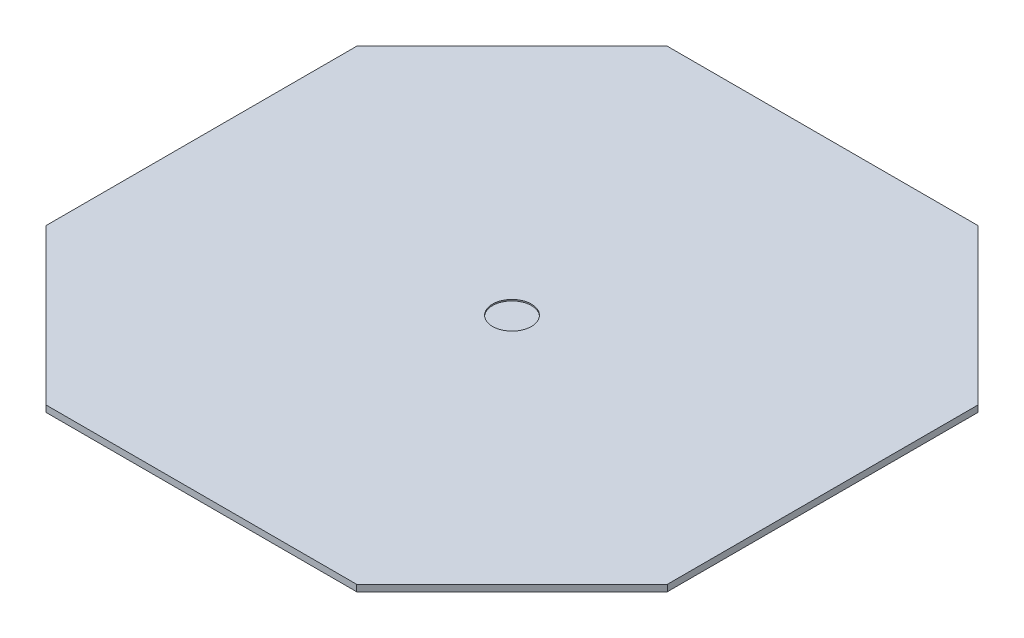
ISO-10303-21;
HEADER;
FILE_DESCRIPTION(('STEP AP214'),'2;1');
FILE_NAME('part.step','',(''),(''),'','','');
FILE_SCHEMA(('AUTOMOTIVE_DESIGN { 1 0 10303 214 1 1 1 1 }'));
ENDSEC;
DATA;
#1=APPLICATION_CONTEXT('core data for automotive mechanical design processes');
#2=APPLICATION_PROTOCOL_DEFINITION('international standard','automotive_design',2000,#1);
#3=PRODUCT_CONTEXT('',#1,'mechanical');
#4=PRODUCT('Part','Part','',(#3));
#5=PRODUCT_RELATED_PRODUCT_CATEGORY('part','',(#4));
#6=PRODUCT_DEFINITION_FORMATION('','',#4);
#7=PRODUCT_DEFINITION_CONTEXT('part definition',#1,'design');
#8=PRODUCT_DEFINITION('design','',#6,#7);
#9=PRODUCT_DEFINITION_SHAPE('','',#8);
#10=(LENGTH_UNIT() NAMED_UNIT(*) SI_UNIT(.MILLI.,.METRE.));
#11=(NAMED_UNIT(*) PLANE_ANGLE_UNIT() SI_UNIT($,.RADIAN.));
#12=(NAMED_UNIT(*) SI_UNIT($,.STERADIAN.) SOLID_ANGLE_UNIT());
#13=UNCERTAINTY_MEASURE_WITH_UNIT(LENGTH_MEASURE(1.E-05),#10,'distance_accuracy_value','');
#14=(GEOMETRIC_REPRESENTATION_CONTEXT(3) GLOBAL_UNCERTAINTY_ASSIGNED_CONTEXT((#13)) GLOBAL_UNIT_ASSIGNED_CONTEXT((#10,
#11,#12)) REPRESENTATION_CONTEXT('',''));
#15=CARTESIAN_POINT('',(0.,0.,0.));
#16=DIRECTION('',(0.,0.,1.));
#17=DIRECTION('',(1.,0.,0.));
#18=AXIS2_PLACEMENT_3D('',#15,#16,#17);
#19=CARTESIAN_POINT('',(-457.2,12.7,-457.2));
#20=DIRECTION('',(-0.707106781186547,0.,-0.707106781186548));
#21=DIRECTION('',(-0.707106781186548,0.,0.707106781186547));
#22=AXIS2_PLACEMENT_3D('',#19,#20,#21);
#23=PLANE('',#22);
#24=DIRECTION('',(0.707106781186548,0.,-0.707106781186547));
#25=VECTOR('',#24,1.);
#26=CARTESIAN_POINT('',(-457.2,0.,-457.2));
#27=LINE('',#26,#25);
#28=CARTESIAN_POINT('',(-609.6,0.,-304.8));
#29=VERTEX_POINT('',#28);
#30=CARTESIAN_POINT('',(-304.8,0.,-609.6));
#31=VERTEX_POINT('',#30);
#32=EDGE_CURVE('E128',#29,#31,#27,.T.);
#33=ORIENTED_EDGE('',*,*,#32,.F.);
#34=DIRECTION('',(0.,-1.,0.));
#35=VECTOR('',#34,1.);
#36=CARTESIAN_POINT('',(-609.6,12.7,-304.8));
#37=LINE('',#36,#35);
#38=CARTESIAN_POINT('',(-609.6,12.7,-304.8));
#39=VERTEX_POINT('',#38);
#40=EDGE_CURVE('E11',#39,#29,#37,.T.);
#41=ORIENTED_EDGE('',*,*,#40,.F.);
#42=DIRECTION('',(0.707106781186548,0.,-0.707106781186547));
#43=VECTOR('',#42,1.);
#44=CARTESIAN_POINT('',(-457.2,12.7,-457.2));
#45=LINE('',#44,#43);
#46=CARTESIAN_POINT('',(-304.8,12.7,-609.6));
#47=VERTEX_POINT('',#46);
#48=EDGE_CURVE('E149',#39,#47,#45,.T.);
#49=ORIENTED_EDGE('',*,*,#48,.T.);
#50=DIRECTION('',(0.,-1.,0.));
#51=VECTOR('',#50,1.);
#52=CARTESIAN_POINT('',(-304.8,12.7,-609.6));
#53=LINE('',#52,#51);
#54=EDGE_CURVE('E51',#47,#31,#53,.T.);
#55=ORIENTED_EDGE('',*,*,#54,.T.);
#56=EDGE_LOOP('',(#33,#41,#49,#55));
#57=FACE_BOUND('',#56,.T.);
#58=ADVANCED_FACE('F35',(#57),#23,.T.);
#59=CARTESIAN_POINT('',(-609.6,12.7,1.11022302462516E-13));
#60=DIRECTION('',(-1.,0.,0.));
#61=DIRECTION('',(0.,0.,1.));
#62=AXIS2_PLACEMENT_3D('',#59,#60,#61);
#63=PLANE('',#62);
#64=DIRECTION('',(0.,0.,-1.));
#65=VECTOR('',#64,1.);
#66=CARTESIAN_POINT('',(-609.6,0.,1.11022302462516E-13));
#67=LINE('',#66,#65);
#68=CARTESIAN_POINT('',(-609.6,0.,304.8));
#69=VERTEX_POINT('',#68);
#70=EDGE_CURVE('E130',#69,#29,#67,.T.);
#71=ORIENTED_EDGE('',*,*,#70,.F.);
#72=DIRECTION('',(0.,-1.,0.));
#73=VECTOR('',#72,1.);
#74=CARTESIAN_POINT('',(-609.6,12.7,304.8));
#75=LINE('',#74,#73);
#76=CARTESIAN_POINT('',(-609.6,12.7,304.8));
#77=VERTEX_POINT('',#76);
#78=EDGE_CURVE('E43',#77,#69,#75,.T.);
#79=ORIENTED_EDGE('',*,*,#78,.F.);
#80=DIRECTION('',(0.,0.,-1.));
#81=VECTOR('',#80,1.);
#82=CARTESIAN_POINT('',(-609.6,12.7,1.11022302462516E-13));
#83=LINE('',#82,#81);
#84=EDGE_CURVE('E175',#77,#39,#83,.T.);
#85=ORIENTED_EDGE('',*,*,#84,.T.);
#86=ORIENTED_EDGE('',*,*,#40,.T.);
#87=EDGE_LOOP('',(#71,#79,#85,#86));
#88=FACE_BOUND('',#87,.T.);
#89=ADVANCED_FACE('F166',(#88),#63,.T.);
#90=CARTESIAN_POINT('',(-457.2,12.7,457.2));
#91=DIRECTION('',(-0.707106781186547,0.,0.707106781186548));
#92=DIRECTION('',(0.707106781186548,0.,0.707106781186547));
#93=AXIS2_PLACEMENT_3D('',#90,#91,#92);
#94=PLANE('',#93);
#95=DIRECTION('',(-0.707106781186548,0.,-0.707106781186547));
#96=VECTOR('',#95,1.);
#97=CARTESIAN_POINT('',(-457.2,0.,457.2));
#98=LINE('',#97,#96);
#99=CARTESIAN_POINT('',(-304.8,0.,609.6));
#100=VERTEX_POINT('',#99);
#101=EDGE_CURVE('E134',#100,#69,#98,.T.);
#102=ORIENTED_EDGE('',*,*,#101,.F.);
#103=DIRECTION('',(0.,-1.,0.));
#104=VECTOR('',#103,1.);
#105=CARTESIAN_POINT('',(-304.8,12.7,609.6));
#106=LINE('',#105,#104);
#107=CARTESIAN_POINT('',(-304.8,12.7,609.6));
#108=VERTEX_POINT('',#107);
#109=EDGE_CURVE('E155',#108,#100,#106,.T.);
#110=ORIENTED_EDGE('',*,*,#109,.F.);
#111=DIRECTION('',(-0.707106781186548,0.,-0.707106781186547));
#112=VECTOR('',#111,1.);
#113=CARTESIAN_POINT('',(-457.2,12.7,457.2));
#114=LINE('',#113,#112);
#115=EDGE_CURVE('E162',#108,#77,#114,.T.);
#116=ORIENTED_EDGE('',*,*,#115,.T.);
#117=ORIENTED_EDGE('',*,*,#78,.T.);
#118=EDGE_LOOP('',(#102,#110,#116,#117));
#119=FACE_BOUND('',#118,.T.);
#120=ADVANCED_FACE('F160',(#119),#94,.T.);
#121=CARTESIAN_POINT('',(1.11022302462516E-13,12.7,609.6));
#122=DIRECTION('',(0.,0.,1.));
#123=DIRECTION('',(1.,0.,0.));
#124=AXIS2_PLACEMENT_3D('',#121,#122,#123);
#125=PLANE('',#124);
#126=DIRECTION('',(-1.,0.,0.));
#127=VECTOR('',#126,1.);
#128=CARTESIAN_POINT('',(1.11022302462516E-13,0.,609.6));
#129=LINE('',#128,#127);
#130=CARTESIAN_POINT('',(304.8,0.,609.6));
#131=VERTEX_POINT('',#130);
#132=EDGE_CURVE('E137',#131,#100,#129,.T.);
#133=ORIENTED_EDGE('',*,*,#132,.F.);
#134=DIRECTION('',(0.,-1.,0.));
#135=VECTOR('',#134,1.);
#136=CARTESIAN_POINT('',(304.8,12.7,609.6));
#137=LINE('',#136,#135);
#138=CARTESIAN_POINT('',(304.8,12.7,609.6));
#139=VERTEX_POINT('',#138);
#140=EDGE_CURVE('E153',#139,#131,#137,.T.);
#141=ORIENTED_EDGE('',*,*,#140,.F.);
#142=DIRECTION('',(-1.,0.,0.));
#143=VECTOR('',#142,1.);
#144=CARTESIAN_POINT('',(1.11022302462516E-13,12.7,609.6));
#145=LINE('',#144,#143);
#146=EDGE_CURVE('E174',#139,#108,#145,.T.);
#147=ORIENTED_EDGE('',*,*,#146,.T.);
#148=ORIENTED_EDGE('',*,*,#109,.T.);
#149=EDGE_LOOP('',(#133,#141,#147,#148));
#150=FACE_BOUND('',#149,.T.);
#151=ADVANCED_FACE('F172',(#150),#125,.T.);
#152=CARTESIAN_POINT('',(457.2,12.7,457.2));
#153=DIRECTION('',(0.707106781186548,0.,0.707106781186548));
#154=DIRECTION('',(0.707106781186548,0.,-0.707106781186548));
#155=AXIS2_PLACEMENT_3D('',#152,#153,#154);
#156=PLANE('',#155);
#157=DIRECTION('',(-0.707106781186548,0.,0.707106781186548));
#158=VECTOR('',#157,1.);
#159=CARTESIAN_POINT('',(457.2,0.,457.2));
#160=LINE('',#159,#158);
#161=CARTESIAN_POINT('',(609.6,0.,304.8));
#162=VERTEX_POINT('',#161);
#163=EDGE_CURVE('E140',#162,#131,#160,.T.);
#164=ORIENTED_EDGE('',*,*,#163,.F.);
#165=DIRECTION('',(0.,-1.,0.));
#166=VECTOR('',#165,1.);
#167=CARTESIAN_POINT('',(609.6,12.7,304.8));
#168=LINE('',#167,#166);
#169=CARTESIAN_POINT('',(609.6,12.7,304.8));
#170=VERTEX_POINT('',#169);
#171=EDGE_CURVE('E110',#170,#162,#168,.T.);
#172=ORIENTED_EDGE('',*,*,#171,.F.);
#173=DIRECTION('',(-0.707106781186548,0.,0.707106781186548));
#174=VECTOR('',#173,1.);
#175=CARTESIAN_POINT('',(457.2,12.7,457.2));
#176=LINE('',#175,#174);
#177=EDGE_CURVE('E120',#170,#139,#176,.T.);
#178=ORIENTED_EDGE('',*,*,#177,.T.);
#179=ORIENTED_EDGE('',*,*,#140,.T.);
#180=EDGE_LOOP('',(#164,#172,#178,#179));
#181=FACE_BOUND('',#180,.T.);
#182=ADVANCED_FACE('F181',(#181),#156,.T.);
#183=CARTESIAN_POINT('',(609.6,12.7,-1.11022302462516E-13));
#184=DIRECTION('',(1.,0.,0.));
#185=DIRECTION('',(0.,0.,-1.));
#186=AXIS2_PLACEMENT_3D('',#183,#184,#185);
#187=PLANE('',#186);
#188=DIRECTION('',(0.,0.,1.));
#189=VECTOR('',#188,1.);
#190=CARTESIAN_POINT('',(609.6,0.,-1.11022302462516E-13));
#191=LINE('',#190,#189);
#192=CARTESIAN_POINT('',(609.6,0.,-304.8));
#193=VERTEX_POINT('',#192);
#194=EDGE_CURVE('E106',#193,#162,#191,.T.);
#195=ORIENTED_EDGE('',*,*,#194,.F.);
#196=DIRECTION('',(0.,-1.,0.));
#197=VECTOR('',#196,1.);
#198=CARTESIAN_POINT('',(609.6,12.7,-304.8));
#199=LINE('',#198,#197);
#200=CARTESIAN_POINT('',(609.6,12.7,-304.8));
#201=VERTEX_POINT('',#200);
#202=EDGE_CURVE('E101',#201,#193,#199,.T.);
#203=ORIENTED_EDGE('',*,*,#202,.F.);
#204=DIRECTION('',(0.,0.,1.));
#205=VECTOR('',#204,1.);
#206=CARTESIAN_POINT('',(609.6,12.7,-1.11022302462516E-13));
#207=LINE('',#206,#205);
#208=EDGE_CURVE('E104',#201,#170,#207,.T.);
#209=ORIENTED_EDGE('',*,*,#208,.T.);
#210=ORIENTED_EDGE('',*,*,#171,.T.);
#211=EDGE_LOOP('',(#195,#203,#209,#210));
#212=FACE_BOUND('',#211,.T.);
#213=ADVANCED_FACE('F103',(#212),#187,.T.);
#214=CARTESIAN_POINT('',(457.2,12.7,-457.2));
#215=DIRECTION('',(0.707106781186548,0.,-0.707106781186548));
#216=DIRECTION('',(-0.707106781186548,0.,-0.707106781186548));
#217=AXIS2_PLACEMENT_3D('',#214,#215,#216);
#218=PLANE('',#217);
#219=DIRECTION('',(0.707106781186548,0.,0.707106781186548));
#220=VECTOR('',#219,1.);
#221=CARTESIAN_POINT('',(457.2,0.,-457.2));
#222=LINE('',#221,#220);
#223=CARTESIAN_POINT('',(304.8,0.,-609.6));
#224=VERTEX_POINT('',#223);
#225=EDGE_CURVE('E144',#224,#193,#222,.T.);
#226=ORIENTED_EDGE('',*,*,#225,.F.);
#227=DIRECTION('',(0.,-1.,0.));
#228=VECTOR('',#227,1.);
#229=CARTESIAN_POINT('',(304.8,12.7,-609.6));
#230=LINE('',#229,#228);
#231=CARTESIAN_POINT('',(304.8,12.7,-609.6));
#232=VERTEX_POINT('',#231);
#233=EDGE_CURVE('E76',#232,#224,#230,.T.);
#234=ORIENTED_EDGE('',*,*,#233,.F.);
#235=DIRECTION('',(0.707106781186548,0.,0.707106781186548));
#236=VECTOR('',#235,1.);
#237=CARTESIAN_POINT('',(457.2,12.7,-457.2));
#238=LINE('',#237,#236);
#239=EDGE_CURVE('E117',#232,#201,#238,.T.);
#240=ORIENTED_EDGE('',*,*,#239,.T.);
#241=ORIENTED_EDGE('',*,*,#202,.T.);
#242=EDGE_LOOP('',(#226,#234,#240,#241));
#243=FACE_BOUND('',#242,.T.);
#244=ADVANCED_FACE('F122',(#243),#218,.T.);
#245=CARTESIAN_POINT('',(-2.22044604925031E-13,12.7,-609.6));
#246=DIRECTION('',(0.,0.,-1.));
#247=DIRECTION('',(-1.,0.,0.));
#248=AXIS2_PLACEMENT_3D('',#245,#246,#247);
#249=PLANE('',#248);
#250=DIRECTION('',(1.,0.,0.));
#251=VECTOR('',#250,1.);
#252=CARTESIAN_POINT('',(-2.22044604925031E-13,0.,-609.6));
#253=LINE('',#252,#251);
#254=EDGE_CURVE('E146',#31,#224,#253,.T.);
#255=ORIENTED_EDGE('',*,*,#254,.F.);
#256=ORIENTED_EDGE('',*,*,#54,.F.);
#257=DIRECTION('',(1.,0.,0.));
#258=VECTOR('',#257,1.);
#259=CARTESIAN_POINT('',(-2.22044604925031E-13,12.7,-609.6));
#260=LINE('',#259,#258);
#261=EDGE_CURVE('E123',#47,#232,#260,.T.);
#262=ORIENTED_EDGE('',*,*,#261,.T.);
#263=ORIENTED_EDGE('',*,*,#233,.T.);
#264=EDGE_LOOP('',(#255,#256,#262,#263));
#265=FACE_BOUND('',#264,.T.);
#266=ADVANCED_FACE('F182',(#265),#249,.T.);
#267=CARTESIAN_POINT('',(0.,12.7,0.));
#268=DIRECTION('',(0.,1.,0.));
#269=DIRECTION('',(0.,0.,1.));
#270=AXIS2_PLACEMENT_3D('',#267,#268,#269);
#271=PLANE('',#270);
#272=CARTESIAN_POINT('',(0.,12.7,0.));
#273=DIRECTION('',(0.,1.,0.));
#274=DIRECTION('',(0.,0.,1.));
#275=AXIS2_PLACEMENT_3D('',#272,#273,#274);
#276=CIRCLE('',#275,38.1);
#277=CARTESIAN_POINT('',(0.,12.7,38.1));
#278=VERTEX_POINT('',#277);
#279=EDGE_CURVE('E258',#278,#278,#276,.T.);
#280=ORIENTED_EDGE('',*,*,#279,.F.);
#281=EDGE_LOOP('',(#280));
#282=FACE_BOUND('',#281,.T.);
#283=ORIENTED_EDGE('',*,*,#48,.F.);
#284=ORIENTED_EDGE('',*,*,#84,.F.);
#285=ORIENTED_EDGE('',*,*,#115,.F.);
#286=ORIENTED_EDGE('',*,*,#146,.F.);
#287=ORIENTED_EDGE('',*,*,#177,.F.);
#288=ORIENTED_EDGE('',*,*,#208,.F.);
#289=ORIENTED_EDGE('',*,*,#239,.F.);
#290=ORIENTED_EDGE('',*,*,#261,.F.);
#291=EDGE_LOOP('',(#283,#284,#285,#286,#287,#288,#289,#290));
#292=FACE_BOUND('',#291,.T.);
#293=ADVANCED_FACE('F115',(#282,#292),#271,.T.);
#294=CARTESIAN_POINT('',(0.,0.,0.));
#295=DIRECTION('',(0.,1.,0.));
#296=DIRECTION('',(0.,0.,1.));
#297=AXIS2_PLACEMENT_3D('',#294,#295,#296);
#298=PLANE('',#297);
#299=ORIENTED_EDGE('',*,*,#32,.T.);
#300=ORIENTED_EDGE('',*,*,#254,.T.);
#301=ORIENTED_EDGE('',*,*,#225,.T.);
#302=ORIENTED_EDGE('',*,*,#194,.T.);
#303=ORIENTED_EDGE('',*,*,#163,.T.);
#304=ORIENTED_EDGE('',*,*,#132,.T.);
#305=ORIENTED_EDGE('',*,*,#101,.T.);
#306=ORIENTED_EDGE('',*,*,#70,.T.);
#307=EDGE_LOOP('',(#299,#300,#301,#302,#303,#304,#305,#306));
#308=FACE_BOUND('',#307,.T.);
#309=ADVANCED_FACE('F168',(#308),#298,.F.);
#310=CARTESIAN_POINT('',(0.,10.16,0.));
#311=DIRECTION('',(0.,1.,0.));
#312=DIRECTION('',(0.,0.,1.));
#313=AXIS2_PLACEMENT_3D('',#310,#311,#312);
#314=CYLINDRICAL_SURFACE('',#313,38.1);
#315=CARTESIAN_POINT('',(0.,10.16,0.));
#316=DIRECTION('',(0.,1.,0.));
#317=DIRECTION('',(0.,0.,1.));
#318=AXIS2_PLACEMENT_3D('',#315,#316,#317);
#319=CIRCLE('',#318,38.1);
#320=CARTESIAN_POINT('',(0.,10.16,38.1));
#321=VERTEX_POINT('',#320);
#322=EDGE_CURVE('E131',#321,#321,#319,.T.);
#323=ORIENTED_EDGE('',*,*,#322,.F.);
#324=EDGE_LOOP('',(#323));
#325=FACE_BOUND('',#324,.T.);
#326=ORIENTED_EDGE('',*,*,#279,.T.);
#327=EDGE_LOOP('',(#326));
#328=FACE_BOUND('',#327,.T.);
#329=ADVANCED_FACE('F229',(#325,#328),#314,.F.);
#330=CARTESIAN_POINT('',(0.,10.16,0.));
#331=DIRECTION('',(0.,1.,0.));
#332=DIRECTION('',(0.,0.,1.));
#333=AXIS2_PLACEMENT_3D('',#330,#331,#332);
#334=PLANE('',#333);
#335=ORIENTED_EDGE('',*,*,#322,.T.);
#336=EDGE_LOOP('',(#335));
#337=FACE_BOUND('',#336,.T.);
#338=ADVANCED_FACE('F242',(#337),#334,.T.);
#339=CLOSED_SHELL('',(#58,#89,#120,#151,#182,#213,#244,#266,#293,#309,#329,#338));
#340=MANIFOLD_SOLID_BREP('B2',#339);
#341=ADVANCED_BREP_SHAPE_REPRESENTATION('',(#18,#340),#14);
#342=SHAPE_DEFINITION_REPRESENTATION(#9,#341);
ENDSEC;
END-ISO-10303-21;
